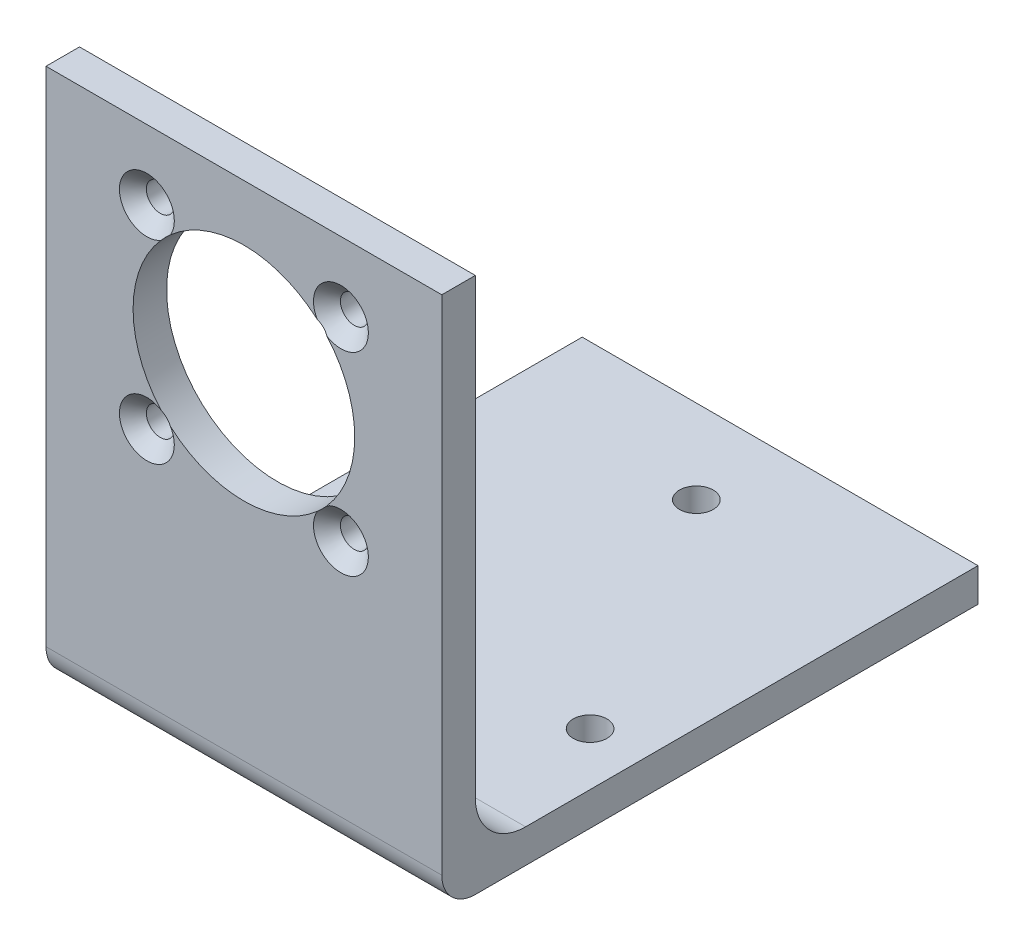
ISO-10303-21;
HEADER;
FILE_DESCRIPTION(('STEP AP214'),'2;1');
FILE_NAME('part.step','',(''),(''),'','','');
FILE_SCHEMA(('AUTOMOTIVE_DESIGN { 1 0 10303 214 1 1 1 1 }'));
ENDSEC;
DATA;
#1=APPLICATION_CONTEXT('core data for automotive mechanical design processes');
#2=APPLICATION_PROTOCOL_DEFINITION('international standard','automotive_design',2000,#1);
#3=PRODUCT_CONTEXT('',#1,'mechanical');
#4=PRODUCT('Part','Part','',(#3));
#5=PRODUCT_RELATED_PRODUCT_CATEGORY('part','',(#4));
#6=PRODUCT_DEFINITION_FORMATION('','',#4);
#7=PRODUCT_DEFINITION_CONTEXT('part definition',#1,'design');
#8=PRODUCT_DEFINITION('design','',#6,#7);
#9=PRODUCT_DEFINITION_SHAPE('','',#8);
#10=(LENGTH_UNIT() NAMED_UNIT(*) SI_UNIT(.MILLI.,.METRE.));
#11=(NAMED_UNIT(*) PLANE_ANGLE_UNIT() SI_UNIT($,.RADIAN.));
#12=(NAMED_UNIT(*) SI_UNIT($,.STERADIAN.) SOLID_ANGLE_UNIT());
#13=UNCERTAINTY_MEASURE_WITH_UNIT(LENGTH_MEASURE(1.E-05),#10,'distance_accuracy_value','');
#14=(GEOMETRIC_REPRESENTATION_CONTEXT(3) GLOBAL_UNCERTAINTY_ASSIGNED_CONTEXT((#13)) GLOBAL_UNIT_ASSIGNED_CONTEXT((#10,
#11,#12)) REPRESENTATION_CONTEXT('',''));
#15=CARTESIAN_POINT('',(0.,0.,0.));
#16=DIRECTION('',(0.,0.,1.));
#17=DIRECTION('',(1.,0.,0.));
#18=AXIS2_PLACEMENT_3D('',#15,#16,#17);
#19=CARTESIAN_POINT('',(75.,0.,0.));
#20=DIRECTION('',(0.,0.,-1.));
#21=DIRECTION('',(-1.,0.,0.));
#22=AXIS2_PLACEMENT_3D('',#19,#20,#21);
#23=PLANE('',#22);
#24=DIRECTION('',(0.,-1.,0.));
#25=VECTOR('',#24,1.);
#26=CARTESIAN_POINT('',(0.,0.,0.));
#27=LINE('',#26,#25);
#28=CARTESIAN_POINT('',(0.,101.6,0.));
#29=VERTEX_POINT('',#28);
#30=CARTESIAN_POINT('',(0.,6.35,0.));
#31=VERTEX_POINT('',#30);
#32=EDGE_CURVE('E161',#29,#31,#27,.T.);
#33=ORIENTED_EDGE('',*,*,#32,.T.);
#34=DIRECTION('',(-1.,0.,0.));
#35=VECTOR('',#34,1.);
#36=CARTESIAN_POINT('',(75.,6.35,0.));
#37=LINE('',#36,#35);
#38=CARTESIAN_POINT('',(75.,6.35,0.));
#39=VERTEX_POINT('',#38);
#40=EDGE_CURVE('E231',#31,#39,#37,.F.);
#41=ORIENTED_EDGE('',*,*,#40,.T.);
#42=DIRECTION('',(0.,-1.,0.));
#43=VECTOR('',#42,1.);
#44=CARTESIAN_POINT('',(75.,0.,0.));
#45=LINE('',#44,#43);
#46=CARTESIAN_POINT('',(75.,101.6,0.));
#47=VERTEX_POINT('',#46);
#48=EDGE_CURVE('E176',#47,#39,#45,.T.);
#49=ORIENTED_EDGE('',*,*,#48,.F.);
#50=DIRECTION('',(-1.,0.,0.));
#51=VECTOR('',#50,1.);
#52=CARTESIAN_POINT('',(75.,101.6,0.));
#53=LINE('',#52,#51);
#54=EDGE_CURVE('E180',#47,#29,#53,.T.);
#55=ORIENTED_EDGE('',*,*,#54,.T.);
#56=EDGE_LOOP('',(#33,#41,#49,#55));
#57=FACE_BOUND('',#56,.T.);
#58=CARTESIAN_POINT('',(55.8847763108504,51.6152236891499,0.));
#59=DIRECTION('',(0.,0.,1.));
#60=DIRECTION('',(1.,0.,0.));
#61=AXIS2_PLACEMENT_3D('',#58,#59,#60);
#62=CIRCLE('',#61,5.2);
#63=CARTESIAN_POINT('',(51.4142663554246,54.2712622314981,0.));
#64=VERTEX_POINT('',#63);
#65=CARTESIAN_POINT('',(53.2287377685021,56.0857336445756,0.));
#66=VERTEX_POINT('',#65);
#67=EDGE_CURVE('E54',#64,#66,#62,.T.);
#68=ORIENTED_EDGE('',*,*,#67,.F.);
#69=CARTESIAN_POINT('',(37.5,70.,0.));
#70=DIRECTION('',(0.,0.,-1.));
#71=DIRECTION('',(-1.,0.,0.));
#72=AXIS2_PLACEMENT_3D('',#69,#70,#71);
#73=CIRCLE('',#72,21.);
#74=CARTESIAN_POINT('',(23.5857336445755,54.271262231498,0.));
#75=VERTEX_POINT('',#74);
#76=EDGE_CURVE('E61',#64,#75,#73,.T.);
#77=ORIENTED_EDGE('',*,*,#76,.T.);
#78=CARTESIAN_POINT('',(19.1152236891497,51.6152236891498,0.));
#79=DIRECTION('',(0.,0.,1.));
#80=DIRECTION('',(1.,0.,0.));
#81=AXIS2_PLACEMENT_3D('',#78,#79,#80);
#82=CIRCLE('',#81,5.2);
#83=CARTESIAN_POINT('',(21.7712622314979,56.0857336445756,0.));
#84=VERTEX_POINT('',#83);
#85=EDGE_CURVE('E466',#84,#75,#82,.T.);
#86=ORIENTED_EDGE('',*,*,#85,.F.);
#87=CARTESIAN_POINT('',(21.771262231498,83.9142663554245,0.));
#88=VERTEX_POINT('',#87);
#89=EDGE_CURVE('E143',#84,#88,#73,.T.);
#90=ORIENTED_EDGE('',*,*,#89,.T.);
#91=CARTESIAN_POINT('',(19.1152236891497,88.3847763108502,0.));
#92=DIRECTION('',(0.,0.,1.));
#93=DIRECTION('',(1.,0.,0.));
#94=AXIS2_PLACEMENT_3D('',#91,#92,#93);
#95=CIRCLE('',#94,5.2);
#96=CARTESIAN_POINT('',(23.5857336445755,85.728737768502,0.));
#97=VERTEX_POINT('',#96);
#98=EDGE_CURVE('E412',#97,#88,#95,.T.);
#99=ORIENTED_EDGE('',*,*,#98,.F.);
#100=CARTESIAN_POINT('',(51.4142663554245,85.728737768502,0.));
#101=VERTEX_POINT('',#100);
#102=EDGE_CURVE('E148',#97,#101,#73,.T.);
#103=ORIENTED_EDGE('',*,*,#102,.T.);
#104=CARTESIAN_POINT('',(55.8847763108503,88.3847763108502,0.));
#105=DIRECTION('',(0.,0.,1.));
#106=DIRECTION('',(1.,0.,0.));
#107=AXIS2_PLACEMENT_3D('',#104,#105,#106);
#108=CIRCLE('',#107,5.2);
#109=CARTESIAN_POINT('',(53.228737768502,83.9142663554245,0.));
#110=VERTEX_POINT('',#109);
#111=EDGE_CURVE('E454',#110,#101,#108,.T.);
#112=ORIENTED_EDGE('',*,*,#111,.F.);
#113=EDGE_CURVE('E133',#110,#66,#73,.T.);
#114=ORIENTED_EDGE('',*,*,#113,.T.);
#115=EDGE_LOOP('',(#68,#77,#86,#90,#99,#103,#112,#114));
#116=FACE_BOUND('',#115,.T.);
#117=ADVANCED_FACE('F39',(#57,#116),#23,.F.);
#118=CARTESIAN_POINT('',(75.,0.,-101.6));
#119=DIRECTION('',(0.,1.,0.));
#120=DIRECTION('',(0.,0.,1.));
#121=AXIS2_PLACEMENT_3D('',#118,#119,#120);
#122=PLANE('',#121);
#123=CARTESIAN_POINT('',(37.5,0.,-85.7292648054294));
#124=DIRECTION('',(0.,1.,0.));
#125=DIRECTION('',(0.,0.,1.));
#126=AXIS2_PLACEMENT_3D('',#123,#124,#125);
#127=CIRCLE('',#126,3.19999999999999);
#128=CARTESIAN_POINT('',(37.5,0.,-82.5292648054294));
#129=VERTEX_POINT('',#128);
#130=EDGE_CURVE('E487',#129,#129,#127,.T.);
#131=ORIENTED_EDGE('',*,*,#130,.T.);
#132=EDGE_LOOP('',(#131));
#133=FACE_BOUND('',#132,.T.);
#134=CARTESIAN_POINT('',(65.,0.,-38.0978675972853));
#135=DIRECTION('',(0.,1.,0.));
#136=DIRECTION('',(0.,0.,1.));
#137=AXIS2_PLACEMENT_3D('',#134,#135,#136);
#138=CIRCLE('',#137,3.19999999999999);
#139=CARTESIAN_POINT('',(65.,0.,-34.8978675972853));
#140=VERTEX_POINT('',#139);
#141=EDGE_CURVE('E479',#140,#140,#138,.T.);
#142=ORIENTED_EDGE('',*,*,#141,.T.);
#143=EDGE_LOOP('',(#142));
#144=FACE_BOUND('',#143,.T.);
#145=CARTESIAN_POINT('',(9.99999999999997,0.,-38.0978675972853));
#146=DIRECTION('',(0.,1.,0.));
#147=DIRECTION('',(0.,0.,1.));
#148=AXIS2_PLACEMENT_3D('',#145,#146,#147);
#149=CIRCLE('',#148,3.2);
#150=CARTESIAN_POINT('',(9.99999999999997,0.,-34.8978675972853));
#151=VERTEX_POINT('',#150);
#152=EDGE_CURVE('E136',#151,#151,#149,.T.);
#153=ORIENTED_EDGE('',*,*,#152,.T.);
#154=EDGE_LOOP('',(#153));
#155=FACE_BOUND('',#154,.T.);
#156=DIRECTION('',(0.,0.,-1.));
#157=VECTOR('',#156,1.);
#158=CARTESIAN_POINT('',(75.,0.,-101.6));
#159=LINE('',#158,#157);
#160=CARTESIAN_POINT('',(75.,0.,-6.34999999999999));
#161=VERTEX_POINT('',#160);
#162=CARTESIAN_POINT('',(75.,0.,-101.6));
#163=VERTEX_POINT('',#162);
#164=EDGE_CURVE('E157',#161,#163,#159,.T.);
#165=ORIENTED_EDGE('',*,*,#164,.F.);
#166=DIRECTION('',(-1.,0.,0.));
#167=VECTOR('',#166,1.);
#168=CARTESIAN_POINT('',(75.,0.,-6.34999999999999));
#169=LINE('',#168,#167);
#170=CARTESIAN_POINT('',(0.,0.,-6.34999999999999));
#171=VERTEX_POINT('',#170);
#172=EDGE_CURVE('E224',#161,#171,#169,.T.);
#173=ORIENTED_EDGE('',*,*,#172,.T.);
#174=DIRECTION('',(0.,0.,-1.));
#175=VECTOR('',#174,1.);
#176=CARTESIAN_POINT('',(0.,0.,-101.6));
#177=LINE('',#176,#175);
#178=CARTESIAN_POINT('',(0.,0.,-101.6));
#179=VERTEX_POINT('',#178);
#180=EDGE_CURVE('E156',#171,#179,#177,.T.);
#181=ORIENTED_EDGE('',*,*,#180,.T.);
#182=DIRECTION('',(-1.,0.,0.));
#183=VECTOR('',#182,1.);
#184=CARTESIAN_POINT('',(75.,0.,-101.6));
#185=LINE('',#184,#183);
#186=EDGE_CURVE('E220',#163,#179,#185,.T.);
#187=ORIENTED_EDGE('',*,*,#186,.F.);
#188=EDGE_LOOP('',(#165,#173,#181,#187));
#189=FACE_BOUND('',#188,.T.);
#190=ADVANCED_FACE('F268',(#133,#144,#155,#189),#122,.F.);
#191=CARTESIAN_POINT('',(75.,6.35,-101.6));
#192=DIRECTION('',(0.,0.,1.));
#193=DIRECTION('',(1.,0.,0.));
#194=AXIS2_PLACEMENT_3D('',#191,#192,#193);
#195=PLANE('',#194);
#196=DIRECTION('',(0.,1.,0.));
#197=VECTOR('',#196,1.);
#198=CARTESIAN_POINT('',(0.,6.35,-101.6));
#199=LINE('',#198,#197);
#200=CARTESIAN_POINT('',(0.,6.35,-101.6));
#201=VERTEX_POINT('',#200);
#202=EDGE_CURVE('E183',#179,#201,#199,.T.);
#203=ORIENTED_EDGE('',*,*,#202,.T.);
#204=DIRECTION('',(-1.,0.,0.));
#205=VECTOR('',#204,1.);
#206=CARTESIAN_POINT('',(75.,6.35,-101.6));
#207=LINE('',#206,#205);
#208=CARTESIAN_POINT('',(75.,6.35,-101.6));
#209=VERTEX_POINT('',#208);
#210=EDGE_CURVE('E216',#209,#201,#207,.T.);
#211=ORIENTED_EDGE('',*,*,#210,.F.);
#212=DIRECTION('',(0.,1.,0.));
#213=VECTOR('',#212,1.);
#214=CARTESIAN_POINT('',(75.,6.35,-101.6));
#215=LINE('',#214,#213);
#216=EDGE_CURVE('E160',#163,#209,#215,.T.);
#217=ORIENTED_EDGE('',*,*,#216,.F.);
#218=ORIENTED_EDGE('',*,*,#186,.T.);
#219=EDGE_LOOP('',(#203,#211,#217,#218));
#220=FACE_BOUND('',#219,.T.);
#221=ADVANCED_FACE('F274',(#220),#195,.F.);
#222=CARTESIAN_POINT('',(75.,6.35,-15.875));
#223=DIRECTION('',(0.,-1.,0.));
#224=DIRECTION('',(0.,0.,-1.));
#225=AXIS2_PLACEMENT_3D('',#222,#223,#224);
#226=PLANE('',#225);
#227=CARTESIAN_POINT('',(37.5,6.35,-85.7292648054294));
#228=DIRECTION('',(0.,1.,0.));
#229=DIRECTION('',(0.,0.,1.));
#230=AXIS2_PLACEMENT_3D('',#227,#228,#229);
#231=CIRCLE('',#230,3.2);
#232=CARTESIAN_POINT('',(37.5,6.35,-82.5292648054294));
#233=VERTEX_POINT('',#232);
#234=EDGE_CURVE('E491',#233,#233,#231,.T.);
#235=ORIENTED_EDGE('',*,*,#234,.F.);
#236=EDGE_LOOP('',(#235));
#237=FACE_BOUND('',#236,.T.);
#238=CARTESIAN_POINT('',(65.,6.35,-38.0978675972853));
#239=DIRECTION('',(0.,1.,0.));
#240=DIRECTION('',(0.,0.,1.));
#241=AXIS2_PLACEMENT_3D('',#238,#239,#240);
#242=CIRCLE('',#241,3.19999999999999);
#243=CARTESIAN_POINT('',(65.,6.35,-34.8978675972853));
#244=VERTEX_POINT('',#243);
#245=EDGE_CURVE('E483',#244,#244,#242,.T.);
#246=ORIENTED_EDGE('',*,*,#245,.F.);
#247=EDGE_LOOP('',(#246));
#248=FACE_BOUND('',#247,.T.);
#249=CARTESIAN_POINT('',(9.99999999999997,6.35,-38.0978675972853));
#250=DIRECTION('',(0.,1.,0.));
#251=DIRECTION('',(0.,0.,1.));
#252=AXIS2_PLACEMENT_3D('',#249,#250,#251);
#253=CIRCLE('',#252,3.2);
#254=CARTESIAN_POINT('',(9.99999999999997,6.35,-34.8978675972853));
#255=VERTEX_POINT('',#254);
#256=EDGE_CURVE('E475',#255,#255,#253,.T.);
#257=ORIENTED_EDGE('',*,*,#256,.F.);
#258=EDGE_LOOP('',(#257));
#259=FACE_BOUND('',#258,.T.);
#260=DIRECTION('',(0.,0.,1.));
#261=VECTOR('',#260,1.);
#262=CARTESIAN_POINT('',(0.,6.35,-15.875));
#263=LINE('',#262,#261);
#264=CARTESIAN_POINT('',(0.,6.35,-15.875));
#265=VERTEX_POINT('',#264);
#266=EDGE_CURVE('E186',#201,#265,#263,.T.);
#267=ORIENTED_EDGE('',*,*,#266,.T.);
#268=DIRECTION('',(-1.,0.,0.));
#269=VECTOR('',#268,1.);
#270=CARTESIAN_POINT('',(75.,6.35,-15.875));
#271=LINE('',#270,#269);
#272=CARTESIAN_POINT('',(75.,6.35,-15.875));
#273=VERTEX_POINT('',#272);
#274=EDGE_CURVE('E212',#273,#265,#271,.T.);
#275=ORIENTED_EDGE('',*,*,#274,.F.);
#276=DIRECTION('',(0.,0.,1.));
#277=VECTOR('',#276,1.);
#278=CARTESIAN_POINT('',(75.,6.35,-15.875));
#279=LINE('',#278,#277);
#280=EDGE_CURVE('E164',#209,#273,#279,.T.);
#281=ORIENTED_EDGE('',*,*,#280,.F.);
#282=ORIENTED_EDGE('',*,*,#210,.T.);
#283=EDGE_LOOP('',(#267,#275,#281,#282));
#284=FACE_BOUND('',#283,.T.);
#285=ADVANCED_FACE('F291',(#237,#248,#259,#284),#226,.F.);
#286=CARTESIAN_POINT('',(75.,15.875,-15.875));
#287=DIRECTION('',(-1.,0.,0.));
#288=DIRECTION('',(0.,0.,1.));
#289=AXIS2_PLACEMENT_3D('',#286,#287,#288);
#290=CYLINDRICAL_SURFACE('',#289,9.525);
#291=CARTESIAN_POINT('',(0.,15.875,-15.875));
#292=DIRECTION('',(-1.,0.,0.));
#293=DIRECTION('',(0.,0.,-1.));
#294=AXIS2_PLACEMENT_3D('',#291,#292,#293);
#295=CIRCLE('',#294,9.525);
#296=CARTESIAN_POINT('',(0.,15.875,-6.35));
#297=VERTEX_POINT('',#296);
#298=EDGE_CURVE('E189',#265,#297,#295,.T.);
#299=ORIENTED_EDGE('',*,*,#298,.T.);
#300=DIRECTION('',(-1.,0.,0.));
#301=VECTOR('',#300,1.);
#302=CARTESIAN_POINT('',(75.,15.875,-6.35));
#303=LINE('',#302,#301);
#304=CARTESIAN_POINT('',(75.,15.875,-6.35));
#305=VERTEX_POINT('',#304);
#306=EDGE_CURVE('E208',#305,#297,#303,.T.);
#307=ORIENTED_EDGE('',*,*,#306,.F.);
#308=CARTESIAN_POINT('',(75.,15.875,-15.875));
#309=DIRECTION('',(-1.,0.,0.));
#310=DIRECTION('',(0.,0.,-1.));
#311=AXIS2_PLACEMENT_3D('',#308,#309,#310);
#312=CIRCLE('',#311,9.525);
#313=EDGE_CURVE('E167',#273,#305,#312,.T.);
#314=ORIENTED_EDGE('',*,*,#313,.F.);
#315=ORIENTED_EDGE('',*,*,#274,.T.);
#316=EDGE_LOOP('',(#299,#307,#314,#315));
#317=FACE_BOUND('',#316,.T.);
#318=ADVANCED_FACE('F287',(#317),#290,.F.);
#319=CARTESIAN_POINT('',(75.,101.6,-6.35));
#320=DIRECTION('',(0.,0.,1.));
#321=DIRECTION('',(1.,0.,0.));
#322=AXIS2_PLACEMENT_3D('',#319,#320,#321);
#323=PLANE('',#322);
#324=CARTESIAN_POINT('',(55.8847763108504,51.6152236891499,-6.35));
#325=DIRECTION('',(0.,0.,1.));
#326=DIRECTION('',(1.,0.,0.));
#327=AXIS2_PLACEMENT_3D('',#324,#325,#326);
#328=CIRCLE('',#327,2.64999999999999);
#329=CARTESIAN_POINT('',(58.5347763108504,51.6152236891499,-6.35));
#330=VERTEX_POINT('',#329);
#331=EDGE_CURVE('E43',#330,#330,#328,.T.);
#332=ORIENTED_EDGE('',*,*,#331,.T.);
#333=EDGE_LOOP('',(#332));
#334=FACE_BOUND('',#333,.T.);
#335=CARTESIAN_POINT('',(19.1152236891497,51.6152236891498,-6.35));
#336=DIRECTION('',(0.,0.,1.));
#337=DIRECTION('',(1.,0.,0.));
#338=AXIS2_PLACEMENT_3D('',#335,#336,#337);
#339=CIRCLE('',#338,2.64999999999999);
#340=CARTESIAN_POINT('',(21.7652236891497,51.6152236891498,-6.35));
#341=VERTEX_POINT('',#340);
#342=EDGE_CURVE('E408',#341,#341,#339,.T.);
#343=ORIENTED_EDGE('',*,*,#342,.T.);
#344=EDGE_LOOP('',(#343));
#345=FACE_BOUND('',#344,.T.);
#346=CARTESIAN_POINT('',(19.1152236891497,88.3847763108502,-6.35));
#347=DIRECTION('',(0.,0.,1.));
#348=DIRECTION('',(1.,0.,0.));
#349=AXIS2_PLACEMENT_3D('',#346,#347,#348);
#350=CIRCLE('',#349,2.64999999999999);
#351=CARTESIAN_POINT('',(21.7652236891497,88.3847763108502,-6.35));
#352=VERTEX_POINT('',#351);
#353=EDGE_CURVE('E420',#352,#352,#350,.T.);
#354=ORIENTED_EDGE('',*,*,#353,.T.);
#355=EDGE_LOOP('',(#354));
#356=FACE_BOUND('',#355,.T.);
#357=CARTESIAN_POINT('',(55.8847763108503,88.3847763108502,-6.35));
#358=DIRECTION('',(0.,0.,1.));
#359=DIRECTION('',(1.,0.,0.));
#360=AXIS2_PLACEMENT_3D('',#357,#358,#359);
#361=CIRCLE('',#360,2.64999999999999);
#362=CARTESIAN_POINT('',(58.5347763108503,88.3847763108502,-6.35));
#363=VERTEX_POINT('',#362);
#364=EDGE_CURVE('E247',#363,#363,#361,.T.);
#365=ORIENTED_EDGE('',*,*,#364,.T.);
#366=EDGE_LOOP('',(#365));
#367=FACE_BOUND('',#366,.T.);
#368=CARTESIAN_POINT('',(37.5,70.,-6.34999999999999));
#369=DIRECTION('',(0.,0.,1.));
#370=DIRECTION('',(1.,0.,0.));
#371=AXIS2_PLACEMENT_3D('',#368,#369,#370);
#372=CIRCLE('',#371,21.);
#373=CARTESIAN_POINT('',(58.5,70.,-6.34999999999999));
#374=VERTEX_POINT('',#373);
#375=EDGE_CURVE('E147',#374,#374,#372,.F.);
#376=ORIENTED_EDGE('',*,*,#375,.F.);
#377=EDGE_LOOP('',(#376));
#378=FACE_BOUND('',#377,.T.);
#379=DIRECTION('',(0.,1.,0.));
#380=VECTOR('',#379,1.);
#381=CARTESIAN_POINT('',(0.,101.6,-6.35));
#382=LINE('',#381,#380);
#383=CARTESIAN_POINT('',(0.,101.6,-6.35));
#384=VERTEX_POINT('',#383);
#385=EDGE_CURVE('E192',#297,#384,#382,.T.);
#386=ORIENTED_EDGE('',*,*,#385,.T.);
#387=DIRECTION('',(-1.,0.,0.));
#388=VECTOR('',#387,1.);
#389=CARTESIAN_POINT('',(75.,101.6,-6.35));
#390=LINE('',#389,#388);
#391=CARTESIAN_POINT('',(75.,101.6,-6.35));
#392=VERTEX_POINT('',#391);
#393=EDGE_CURVE('E204',#392,#384,#390,.T.);
#394=ORIENTED_EDGE('',*,*,#393,.F.);
#395=DIRECTION('',(0.,1.,0.));
#396=VECTOR('',#395,1.);
#397=CARTESIAN_POINT('',(75.,101.6,-6.35));
#398=LINE('',#397,#396);
#399=EDGE_CURVE('E170',#305,#392,#398,.T.);
#400=ORIENTED_EDGE('',*,*,#399,.F.);
#401=ORIENTED_EDGE('',*,*,#306,.T.);
#402=EDGE_LOOP('',(#386,#394,#400,#401));
#403=FACE_BOUND('',#402,.T.);
#404=ADVANCED_FACE('F283',(#334,#345,#356,#367,#378,#403),#323,.F.);
#405=CARTESIAN_POINT('',(75.,101.6,0.));
#406=DIRECTION('',(0.,-1.,0.));
#407=DIRECTION('',(0.,0.,-1.));
#408=AXIS2_PLACEMENT_3D('',#405,#406,#407);
#409=PLANE('',#408);
#410=DIRECTION('',(0.,0.,1.));
#411=VECTOR('',#410,1.);
#412=CARTESIAN_POINT('',(0.,101.6,0.));
#413=LINE('',#412,#411);
#414=EDGE_CURVE('E195',#384,#29,#413,.T.);
#415=ORIENTED_EDGE('',*,*,#414,.T.);
#416=ORIENTED_EDGE('',*,*,#54,.F.);
#417=DIRECTION('',(0.,0.,1.));
#418=VECTOR('',#417,1.);
#419=CARTESIAN_POINT('',(75.,101.6,0.));
#420=LINE('',#419,#418);
#421=EDGE_CURVE('E173',#392,#47,#420,.T.);
#422=ORIENTED_EDGE('',*,*,#421,.F.);
#423=ORIENTED_EDGE('',*,*,#393,.T.);
#424=EDGE_LOOP('',(#415,#416,#422,#423));
#425=FACE_BOUND('',#424,.T.);
#426=ADVANCED_FACE('F279',(#425),#409,.F.);
#427=CARTESIAN_POINT('',(75.,15.875,-15.875));
#428=DIRECTION('',(1.,0.,0.));
#429=DIRECTION('',(0.,0.,-1.));
#430=AXIS2_PLACEMENT_3D('',#427,#428,#429);
#431=PLANE('',#430);
#432=ORIENTED_EDGE('',*,*,#48,.T.);
#433=CARTESIAN_POINT('',(75.,6.35,-6.34999999999999));
#434=DIRECTION('',(1.,0.,0.));
#435=DIRECTION('',(0.,0.,-1.));
#436=AXIS2_PLACEMENT_3D('',#433,#434,#435);
#437=CIRCLE('',#436,6.35);
#438=EDGE_CURVE('E234',#39,#161,#437,.T.);
#439=ORIENTED_EDGE('',*,*,#438,.T.);
#440=ORIENTED_EDGE('',*,*,#164,.T.);
#441=ORIENTED_EDGE('',*,*,#216,.T.);
#442=ORIENTED_EDGE('',*,*,#280,.T.);
#443=ORIENTED_EDGE('',*,*,#313,.T.);
#444=ORIENTED_EDGE('',*,*,#399,.T.);
#445=ORIENTED_EDGE('',*,*,#421,.T.);
#446=EDGE_LOOP('',(#432,#439,#440,#441,#442,#443,#444,#445));
#447=FACE_BOUND('',#446,.T.);
#448=ADVANCED_FACE('F282',(#447),#431,.T.);
#449=CARTESIAN_POINT('',(0.,15.875,-15.875));
#450=DIRECTION('',(1.,0.,0.));
#451=DIRECTION('',(0.,0.,-1.));
#452=AXIS2_PLACEMENT_3D('',#449,#450,#451);
#453=PLANE('',#452);
#454=ORIENTED_EDGE('',*,*,#180,.F.);
#455=CARTESIAN_POINT('',(0.,6.35,-6.34999999999999));
#456=DIRECTION('',(1.,0.,0.));
#457=DIRECTION('',(0.,0.,-1.));
#458=AXIS2_PLACEMENT_3D('',#455,#456,#457);
#459=CIRCLE('',#458,6.35);
#460=EDGE_CURVE('E228',#171,#31,#459,.F.);
#461=ORIENTED_EDGE('',*,*,#460,.T.);
#462=ORIENTED_EDGE('',*,*,#32,.F.);
#463=ORIENTED_EDGE('',*,*,#414,.F.);
#464=ORIENTED_EDGE('',*,*,#385,.F.);
#465=ORIENTED_EDGE('',*,*,#298,.F.);
#466=ORIENTED_EDGE('',*,*,#266,.F.);
#467=ORIENTED_EDGE('',*,*,#202,.F.);
#468=EDGE_LOOP('',(#454,#461,#462,#463,#464,#465,#466,#467));
#469=FACE_BOUND('',#468,.T.);
#470=ADVANCED_FACE('F278',(#469),#453,.F.);
#471=CARTESIAN_POINT('',(75.,6.35,-6.34999999999999));
#472=DIRECTION('',(-1.,0.,0.));
#473=DIRECTION('',(0.,0.,1.));
#474=AXIS2_PLACEMENT_3D('',#471,#472,#473);
#475=CYLINDRICAL_SURFACE('',#474,6.35);
#476=ORIENTED_EDGE('',*,*,#438,.F.);
#477=ORIENTED_EDGE('',*,*,#40,.F.);
#478=ORIENTED_EDGE('',*,*,#460,.F.);
#479=ORIENTED_EDGE('',*,*,#172,.F.);
#480=EDGE_LOOP('',(#476,#477,#478,#479));
#481=FACE_BOUND('',#480,.T.);
#482=ADVANCED_FACE('F41',(#481),#475,.T.);
#483=CARTESIAN_POINT('',(37.5,70.,-75.));
#484=DIRECTION('',(0.,0.,1.));
#485=DIRECTION('',(1.,0.,0.));
#486=AXIS2_PLACEMENT_3D('',#483,#484,#485);
#487=CYLINDRICAL_SURFACE('',#486,21.);
#488=CARTESIAN_POINT('',(53.2291714544129,56.0862239001168,0.000199999999999631));
#489=CARTESIAN_POINT('',(53.1459576326844,55.9921381144116,-0.0382586394562866));
#490=CARTESIAN_POINT('',(53.0608297713285,55.8976183946793,-0.0718704121679718));
#491=CARTESIAN_POINT('',(52.8871166589992,55.7082869463744,-0.128159237403989));
#492=CARTESIAN_POINT('',(52.7985271045654,55.6134749986243,-0.150822178956947));
#493=CARTESIAN_POINT('',(52.6210513933042,55.4270834086249,-0.183394541150016));
#494=CARTESIAN_POINT('',(52.5322461218089,55.3354888502339,-0.193650046478854));
#495=CARTESIAN_POINT('',(52.352781628545,55.1537484291672,-0.2020152158115));
#496=CARTESIAN_POINT('',(52.2621240680732,55.0636013875719,-0.200135325023454));
#497=CARTESIAN_POINT('',(52.0467041902698,54.853269292388,-0.181451323456809));
#498=CARTESIAN_POINT('',(51.9214554614444,54.7340006661146,-0.159499880188639));
#499=CARTESIAN_POINT('',(51.7323791813733,54.5582695367991,-0.111138956859433));
#500=CARTESIAN_POINT('',(51.6685055431175,54.4996490929545,-0.092175164987146));
#501=CARTESIAN_POINT('',(51.5409629091599,54.3840225622774,-0.0494630900949896));
#502=CARTESIAN_POINT('',(51.4772938166154,54.3270155631333,-0.0257175751092652));
#503=CARTESIAN_POINT('',(51.4137760998835,54.2708285455873,0.000200000000003464));
#504=B_SPLINE_CURVE_WITH_KNOTS('',3,(#488,#489,#490,#491,#492,#493,#494,#495,#496,#497,#498,
#499,#500,#501,#502,#503),.UNSPECIFIED.,.F.,.F.,(4,2,2,2,2,2,2,4),(0.,0.39413856134152,
0.788783746490344,1.17214650991721,1.55517934842095,2.07661913007733,2.34274002907719,
2.60870731712099),.UNSPECIFIED.);
#505=EDGE_CURVE('E11',#66,#64,#504,.T.);
#506=ORIENTED_EDGE('',*,*,#505,.F.);
#507=ORIENTED_EDGE('',*,*,#113,.F.);
#508=CARTESIAN_POINT('',(51.4137760998834,85.7291714544128,0.000199999999998763));
#509=CARTESIAN_POINT('',(51.5078618855886,85.6459576326842,-0.0382586394562884));
#510=CARTESIAN_POINT('',(51.6023816053208,85.5608297713284,-0.071870412167975));
#511=CARTESIAN_POINT('',(51.7917130536258,85.387116658999,-0.128159237403993));
#512=CARTESIAN_POINT('',(51.8865250013759,85.2985271045653,-0.150822178956952));
#513=CARTESIAN_POINT('',(52.0729165913753,85.1210513933041,-0.183394541150019));
#514=CARTESIAN_POINT('',(52.1645111497662,85.0322461218088,-0.193650046478855));
#515=CARTESIAN_POINT('',(52.3462515708329,84.8527816285448,-0.202015215811502));
#516=CARTESIAN_POINT('',(52.4363986124282,84.7621240680731,-0.200135325023457));
#517=CARTESIAN_POINT('',(52.6467307076121,84.5467041902696,-0.181451323456813));
#518=CARTESIAN_POINT('',(52.7659993338855,84.4214554614443,-0.159499880188643));
#519=CARTESIAN_POINT('',(52.941730463201,84.2323791813731,-0.111138956859438));
#520=CARTESIAN_POINT('',(53.0003509070457,84.1685055431174,-0.0921751649871519));
#521=CARTESIAN_POINT('',(53.1159774377228,84.0409629091597,-0.0494630900949961));
#522=CARTESIAN_POINT('',(53.1729844368668,83.9772938166153,-0.0257175751092717));
#523=CARTESIAN_POINT('',(53.2291714544128,83.9137760998833,0.000199999999998297));
#524=B_SPLINE_CURVE_WITH_KNOTS('',3,(#508,#509,#510,#511,#512,#513,#514,#515,#516,#517,#518,
#519,#520,#521,#522,#523),.UNSPECIFIED.,.F.,.F.,(4,2,2,2,2,2,2,4),(0.,0.394138561341535,
0.788783746490354,1.1721465099172,1.55517934842095,2.07661913007733,2.3427400290772,
2.608707317121),.UNSPECIFIED.);
#525=EDGE_CURVE('E237',#101,#110,#524,.T.);
#526=ORIENTED_EDGE('',*,*,#525,.F.);
#527=ORIENTED_EDGE('',*,*,#102,.F.);
#528=CARTESIAN_POINT('',(21.7708285455872,83.9137760998833,0.000200000000000577));
#529=CARTESIAN_POINT('',(21.8540423673157,84.0078618855886,-0.0382586394562887));
#530=CARTESIAN_POINT('',(21.9391702286716,84.1023816053208,-0.0718704121679736));
#531=CARTESIAN_POINT('',(22.1128833410009,84.2917130536257,-0.128159237403988));
#532=CARTESIAN_POINT('',(22.2014728954346,84.3865250013758,-0.150822178956945));
#533=CARTESIAN_POINT('',(22.3789486066959,84.5729165913753,-0.183394541150012));
#534=CARTESIAN_POINT('',(22.4677538781911,84.6645111497662,-0.19365004647885));
#535=CARTESIAN_POINT('',(22.6472183714551,84.8462515708329,-0.202015215811498));
#536=CARTESIAN_POINT('',(22.7378759319268,84.9363986124282,-0.200135325023452));
#537=CARTESIAN_POINT('',(22.9532958097303,85.1467307076121,-0.181451323456808));
#538=CARTESIAN_POINT('',(23.0785445385557,85.2659993338855,-0.159499880188641));
#539=CARTESIAN_POINT('',(23.2676208186268,85.441730463201,-0.111138956859434));
#540=CARTESIAN_POINT('',(23.3314944568825,85.5003509070456,-0.0921751649871457));
#541=CARTESIAN_POINT('',(23.4590370908402,85.6159774377227,-0.0494630900949887));
#542=CARTESIAN_POINT('',(23.5227061833846,85.6729844368668,-0.0257175751092654));
#543=CARTESIAN_POINT('',(23.5862239001166,85.7291714544128,0.000200000000000694));
#544=B_SPLINE_CURVE_WITH_KNOTS('',3,(#528,#529,#530,#531,#532,#533,#534,#535,#536,#537,#538,
#539,#540,#541,#542,#543),.UNSPECIFIED.,.F.,.F.,(4,2,2,2,2,2,2,4),(0.,0.394138561341521,
0.788783746490342,1.17214650991719,1.55517934842094,2.07661913007731,2.34274002907718,
2.60870731712096),.UNSPECIFIED.);
#545=EDGE_CURVE('E246',#88,#97,#544,.T.);
#546=ORIENTED_EDGE('',*,*,#545,.F.);
#547=ORIENTED_EDGE('',*,*,#89,.F.);
#548=CARTESIAN_POINT('',(23.5862239001166,54.2708285455872,0.0002));
#549=CARTESIAN_POINT('',(23.4921381144114,54.3540423673158,-0.0382586394562885));
#550=CARTESIAN_POINT('',(23.3976183946792,54.4391702286716,-0.0718704121679738));
#551=CARTESIAN_POINT('',(23.2082869463742,54.612883341001,-0.128159237403991));
#552=CARTESIAN_POINT('',(23.1134749986241,54.7014728954347,-0.150822178956949));
#553=CARTESIAN_POINT('',(22.9270834086247,54.8789486066959,-0.18339454115002));
#554=CARTESIAN_POINT('',(22.8354888502338,54.9677538781912,-0.193650046478861));
#555=CARTESIAN_POINT('',(22.6537484291671,55.1472183714552,-0.20201521581151));
#556=CARTESIAN_POINT('',(22.5636013875718,55.2378759319269,-0.200135325023462));
#557=CARTESIAN_POINT('',(22.3532692923879,55.4532958097304,-0.181451323456814));
#558=CARTESIAN_POINT('',(22.2340006661145,55.5785445385557,-0.159499880188646));
#559=CARTESIAN_POINT('',(22.058269536799,55.7676208186269,-0.111138956859439));
#560=CARTESIAN_POINT('',(21.9996490929543,55.8314944568826,-0.0921751649871508));
#561=CARTESIAN_POINT('',(21.8840225622772,55.9590370908403,-0.0494630900949926));
#562=CARTESIAN_POINT('',(21.8270155631331,56.0227061833847,-0.0257175751092682));
#563=CARTESIAN_POINT('',(21.7708285455872,56.0862239001167,0.000200000000000126));
#564=B_SPLINE_CURVE_WITH_KNOTS('',3,(#548,#549,#550,#551,#552,#553,#554,#555,#556,#557,#558,
#559,#560,#561,#562,#563),.UNSPECIFIED.,.F.,.F.,(4,2,2,2,2,2,2,4),(0.,0.39413856134152,
0.788783746490347,1.17214650991719,1.55517934842095,2.07661913007735,2.34274002907723,
2.60870731712103),.UNSPECIFIED.);
#565=EDGE_CURVE('E49',#75,#84,#564,.T.);
#566=ORIENTED_EDGE('',*,*,#565,.F.);
#567=ORIENTED_EDGE('',*,*,#76,.F.);
#568=EDGE_LOOP('',(#506,#507,#526,#527,#546,#547,#566,#567));
#569=FACE_BOUND('',#568,.T.);
#570=ORIENTED_EDGE('',*,*,#375,.T.);
#571=EDGE_LOOP('',(#570));
#572=FACE_BOUND('',#571,.T.);
#573=ADVANCED_FACE('F139',(#569,#572),#487,.F.);
#574=CARTESIAN_POINT('',(55.8847763108503,88.3847763108502,0.));
#575=DIRECTION('',(0.,0.,1.));
#576=DIRECTION('',(1.,0.,0.));
#577=AXIS2_PLACEMENT_3D('',#574,#575,#576);
#578=CYLINDRICAL_SURFACE('',#577,2.64999999999999);
#579=CARTESIAN_POINT('',(55.8847763108503,88.3847763108502,-2.55));
#580=DIRECTION('',(0.,0.,1.));
#581=DIRECTION('',(1.,0.,0.));
#582=AXIS2_PLACEMENT_3D('',#579,#580,#581);
#583=CIRCLE('',#582,2.65);
#584=CARTESIAN_POINT('',(58.5347763108503,88.3847763108502,-2.55));
#585=VERTEX_POINT('',#584);
#586=EDGE_CURVE('E151',#585,#585,#583,.T.);
#587=ORIENTED_EDGE('',*,*,#586,.T.);
#588=EDGE_LOOP('',(#587));
#589=FACE_BOUND('',#588,.T.);
#590=ORIENTED_EDGE('',*,*,#364,.F.);
#591=EDGE_LOOP('',(#590));
#592=FACE_BOUND('',#591,.T.);
#593=ADVANCED_FACE('F257',(#589,#592),#578,.F.);
#594=CARTESIAN_POINT('',(55.8847763108503,88.3847763108502,0.));
#595=DIRECTION('',(0.,0.,1.));
#596=DIRECTION('',(1.,0.,0.));
#597=AXIS2_PLACEMENT_3D('',#594,#595,#596);
#598=CONICAL_SURFACE('',#597,5.2,0.785398163397447);
#599=ORIENTED_EDGE('',*,*,#525,.T.);
#600=ORIENTED_EDGE('',*,*,#111,.T.);
#601=EDGE_LOOP('',(#599,#600));
#602=FACE_BOUND('',#601,.T.);
#603=ORIENTED_EDGE('',*,*,#586,.F.);
#604=EDGE_LOOP('',(#603));
#605=FACE_BOUND('',#604,.T.);
#606=ADVANCED_FACE('F252',(#602,#605),#598,.F.);
#607=CARTESIAN_POINT('',(19.1152236891497,88.3847763108502,0.));
#608=DIRECTION('',(0.,0.,1.));
#609=DIRECTION('',(1.,0.,0.));
#610=AXIS2_PLACEMENT_3D('',#607,#608,#609);
#611=CYLINDRICAL_SURFACE('',#610,2.64999999999999);
#612=CARTESIAN_POINT('',(19.1152236891497,88.3847763108502,-2.55));
#613=DIRECTION('',(0.,0.,1.));
#614=DIRECTION('',(1.,0.,0.));
#615=AXIS2_PLACEMENT_3D('',#612,#613,#614);
#616=CIRCLE('',#615,2.65);
#617=CARTESIAN_POINT('',(21.7652236891497,88.3847763108502,-2.55));
#618=VERTEX_POINT('',#617);
#619=EDGE_CURVE('E445',#618,#618,#616,.T.);
#620=ORIENTED_EDGE('',*,*,#619,.T.);
#621=EDGE_LOOP('',(#620));
#622=FACE_BOUND('',#621,.T.);
#623=ORIENTED_EDGE('',*,*,#353,.F.);
#624=EDGE_LOOP('',(#623));
#625=FACE_BOUND('',#624,.T.);
#626=ADVANCED_FACE('F256',(#622,#625),#611,.F.);
#627=CARTESIAN_POINT('',(19.1152236891497,88.3847763108502,0.));
#628=DIRECTION('',(0.,0.,1.));
#629=DIRECTION('',(1.,0.,0.));
#630=AXIS2_PLACEMENT_3D('',#627,#628,#629);
#631=CONICAL_SURFACE('',#630,5.2,0.785398163397447);
#632=ORIENTED_EDGE('',*,*,#545,.T.);
#633=ORIENTED_EDGE('',*,*,#98,.T.);
#634=EDGE_LOOP('',(#632,#633));
#635=FACE_BOUND('',#634,.T.);
#636=ORIENTED_EDGE('',*,*,#619,.F.);
#637=EDGE_LOOP('',(#636));
#638=FACE_BOUND('',#637,.T.);
#639=ADVANCED_FACE('F428',(#635,#638),#631,.F.);
#640=CARTESIAN_POINT('',(19.1152236891497,51.6152236891498,0.));
#641=DIRECTION('',(0.,0.,1.));
#642=DIRECTION('',(1.,0.,0.));
#643=AXIS2_PLACEMENT_3D('',#640,#641,#642);
#644=CYLINDRICAL_SURFACE('',#643,2.64999999999999);
#645=CARTESIAN_POINT('',(19.1152236891497,51.6152236891498,-2.55));
#646=DIRECTION('',(0.,0.,1.));
#647=DIRECTION('',(1.,0.,0.));
#648=AXIS2_PLACEMENT_3D('',#645,#646,#647);
#649=CIRCLE('',#648,2.65);
#650=CARTESIAN_POINT('',(21.7652236891497,51.6152236891498,-2.55));
#651=VERTEX_POINT('',#650);
#652=EDGE_CURVE('E413',#651,#651,#649,.T.);
#653=ORIENTED_EDGE('',*,*,#652,.T.);
#654=EDGE_LOOP('',(#653));
#655=FACE_BOUND('',#654,.T.);
#656=ORIENTED_EDGE('',*,*,#342,.F.);
#657=EDGE_LOOP('',(#656));
#658=FACE_BOUND('',#657,.T.);
#659=ADVANCED_FACE('F425',(#655,#658),#644,.F.);
#660=CARTESIAN_POINT('',(19.1152236891497,51.6152236891498,0.));
#661=DIRECTION('',(0.,0.,1.));
#662=DIRECTION('',(1.,0.,0.));
#663=AXIS2_PLACEMENT_3D('',#660,#661,#662);
#664=CONICAL_SURFACE('',#663,5.2,0.785398163397447);
#665=ORIENTED_EDGE('',*,*,#565,.T.);
#666=ORIENTED_EDGE('',*,*,#85,.T.);
#667=EDGE_LOOP('',(#665,#666));
#668=FACE_BOUND('',#667,.T.);
#669=ORIENTED_EDGE('',*,*,#652,.F.);
#670=EDGE_LOOP('',(#669));
#671=FACE_BOUND('',#670,.T.);
#672=ADVANCED_FACE('F421',(#668,#671),#664,.F.);
#673=CARTESIAN_POINT('',(55.8847763108504,51.6152236891499,0.));
#674=DIRECTION('',(0.,0.,1.));
#675=DIRECTION('',(1.,0.,0.));
#676=AXIS2_PLACEMENT_3D('',#673,#674,#675);
#677=CYLINDRICAL_SURFACE('',#676,2.64999999999999);
#678=CARTESIAN_POINT('',(55.8847763108504,51.6152236891499,-2.55));
#679=DIRECTION('',(0.,0.,1.));
#680=DIRECTION('',(1.,0.,0.));
#681=AXIS2_PLACEMENT_3D('',#678,#679,#680);
#682=CIRCLE('',#681,2.65);
#683=CARTESIAN_POINT('',(58.5347763108504,51.6152236891499,-2.55));
#684=VERTEX_POINT('',#683);
#685=EDGE_CURVE('E135',#684,#684,#682,.T.);
#686=ORIENTED_EDGE('',*,*,#685,.T.);
#687=EDGE_LOOP('',(#686));
#688=FACE_BOUND('',#687,.T.);
#689=ORIENTED_EDGE('',*,*,#331,.F.);
#690=EDGE_LOOP('',(#689));
#691=FACE_BOUND('',#690,.T.);
#692=ADVANCED_FACE('F401',(#688,#691),#677,.F.);
#693=CARTESIAN_POINT('',(55.8847763108504,51.6152236891499,0.));
#694=DIRECTION('',(0.,0.,1.));
#695=DIRECTION('',(1.,0.,0.));
#696=AXIS2_PLACEMENT_3D('',#693,#694,#695);
#697=CONICAL_SURFACE('',#696,5.2,0.785398163397448);
#698=ORIENTED_EDGE('',*,*,#505,.T.);
#699=ORIENTED_EDGE('',*,*,#67,.T.);
#700=EDGE_LOOP('',(#698,#699));
#701=FACE_BOUND('',#700,.T.);
#702=ORIENTED_EDGE('',*,*,#685,.F.);
#703=EDGE_LOOP('',(#702));
#704=FACE_BOUND('',#703,.T.);
#705=ADVANCED_FACE('F127',(#701,#704),#697,.F.);
#706=CARTESIAN_POINT('',(9.99999999999997,6.35,-38.0978675972853));
#707=DIRECTION('',(0.,1.,0.));
#708=DIRECTION('',(0.,0.,1.));
#709=AXIS2_PLACEMENT_3D('',#706,#707,#708);
#710=CYLINDRICAL_SURFACE('',#709,3.2);
#711=ORIENTED_EDGE('',*,*,#152,.F.);
#712=EDGE_LOOP('',(#711));
#713=FACE_BOUND('',#712,.T.);
#714=ORIENTED_EDGE('',*,*,#256,.T.);
#715=EDGE_LOOP('',(#714));
#716=FACE_BOUND('',#715,.T.);
#717=ADVANCED_FACE('F365',(#713,#716),#710,.F.);
#718=CARTESIAN_POINT('',(65.,6.35,-38.0978675972853));
#719=DIRECTION('',(0.,1.,0.));
#720=DIRECTION('',(0.,0.,1.));
#721=AXIS2_PLACEMENT_3D('',#718,#719,#720);
#722=CYLINDRICAL_SURFACE('',#721,3.19999999999999);
#723=ORIENTED_EDGE('',*,*,#141,.F.);
#724=EDGE_LOOP('',(#723));
#725=FACE_BOUND('',#724,.T.);
#726=ORIENTED_EDGE('',*,*,#245,.T.);
#727=EDGE_LOOP('',(#726));
#728=FACE_BOUND('',#727,.T.);
#729=ADVANCED_FACE('F370',(#725,#728),#722,.F.);
#730=CARTESIAN_POINT('',(37.5,6.35,-85.7292648054294));
#731=DIRECTION('',(0.,1.,0.));
#732=DIRECTION('',(0.,0.,1.));
#733=AXIS2_PLACEMENT_3D('',#730,#731,#732);
#734=CYLINDRICAL_SURFACE('',#733,3.2);
#735=ORIENTED_EDGE('',*,*,#130,.F.);
#736=EDGE_LOOP('',(#735));
#737=FACE_BOUND('',#736,.T.);
#738=ORIENTED_EDGE('',*,*,#234,.T.);
#739=EDGE_LOOP('',(#738));
#740=FACE_BOUND('',#739,.T.);
#741=ADVANCED_FACE('F382',(#737,#740),#734,.F.);
#742=CLOSED_SHELL('',(#117,#190,#221,#285,#318,#404,#426,#448,#470,#482,#573,#593,#606,#626,
#639,#659,#672,#692,#705,#717,#729,#741));
#743=MANIFOLD_SOLID_BREP('B2',#742);
#744=ADVANCED_BREP_SHAPE_REPRESENTATION('',(#18,#743),#14);
#745=SHAPE_DEFINITION_REPRESENTATION(#9,#744);
ENDSEC;
END-ISO-10303-21;
